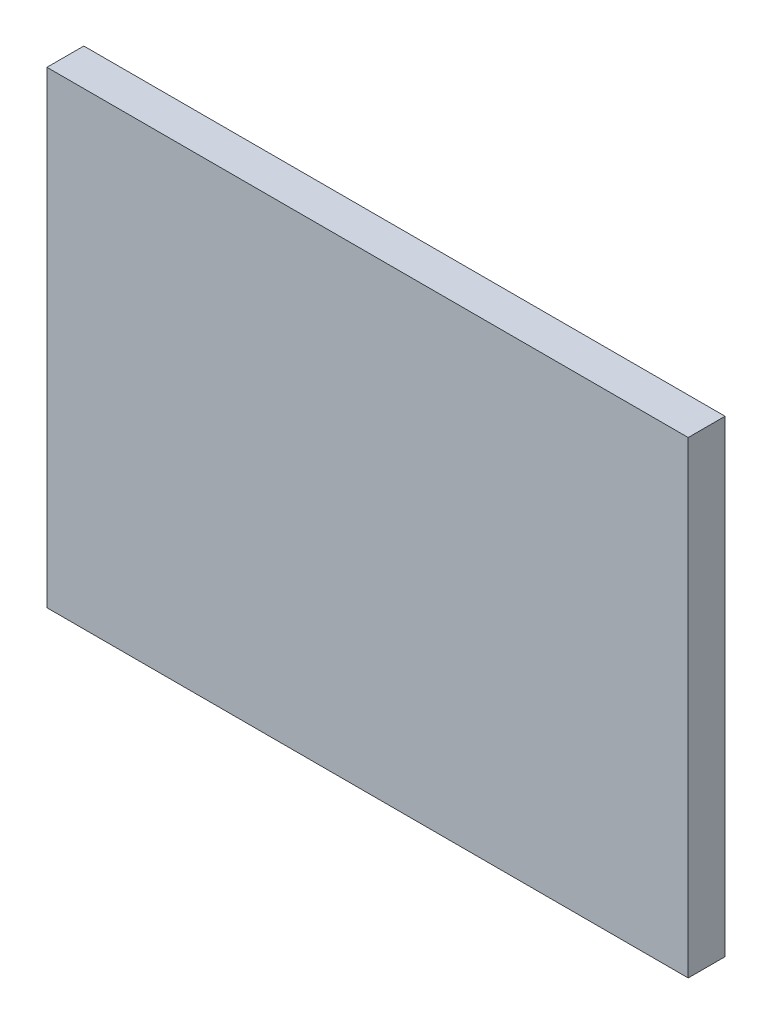
ISO-10303-21;
HEADER;
FILE_DESCRIPTION(('STEP AP214'),'2;1');
FILE_NAME('part.step','',(''),(''),'','','');
FILE_SCHEMA(('AUTOMOTIVE_DESIGN { 1 0 10303 214 1 1 1 1 }'));
ENDSEC;
DATA;
#1=APPLICATION_CONTEXT('core data for automotive mechanical design processes');
#2=APPLICATION_PROTOCOL_DEFINITION('international standard','automotive_design',2000,#1);
#3=PRODUCT_CONTEXT('',#1,'mechanical');
#4=PRODUCT('Part','Part','',(#3));
#5=PRODUCT_RELATED_PRODUCT_CATEGORY('part','',(#4));
#6=PRODUCT_DEFINITION_FORMATION('','',#4);
#7=PRODUCT_DEFINITION_CONTEXT('part definition',#1,'design');
#8=PRODUCT_DEFINITION('design','',#6,#7);
#9=PRODUCT_DEFINITION_SHAPE('','',#8);
#10=(LENGTH_UNIT() NAMED_UNIT(*) SI_UNIT(.MILLI.,.METRE.));
#11=(NAMED_UNIT(*) PLANE_ANGLE_UNIT() SI_UNIT($,.RADIAN.));
#12=(NAMED_UNIT(*) SI_UNIT($,.STERADIAN.) SOLID_ANGLE_UNIT());
#13=UNCERTAINTY_MEASURE_WITH_UNIT(LENGTH_MEASURE(1.E-05),#10,'distance_accuracy_value','');
#14=(GEOMETRIC_REPRESENTATION_CONTEXT(3) GLOBAL_UNCERTAINTY_ASSIGNED_CONTEXT((#13)) GLOBAL_UNIT_ASSIGNED_CONTEXT((#10,
#11,#12)) REPRESENTATION_CONTEXT('',''));
#15=CARTESIAN_POINT('',(0.,0.,0.));
#16=DIRECTION('',(0.,0.,1.));
#17=DIRECTION('',(1.,0.,0.));
#18=AXIS2_PLACEMENT_3D('',#15,#16,#17);
#19=CARTESIAN_POINT('',(-34.798,25.4,4.));
#20=DIRECTION('',(0.,-1.,0.));
#21=DIRECTION('',(1.,0.,0.));
#22=AXIS2_PLACEMENT_3D('',#19,#20,#21);
#23=PLANE('',#22);
#24=DIRECTION('',(-1.,0.,0.));
#25=VECTOR('',#24,1.);
#26=CARTESIAN_POINT('',(-34.798,25.4,0.));
#27=LINE('',#26,#25);
#28=CARTESIAN_POINT('',(34.798,25.4,0.));
#29=VERTEX_POINT('',#28);
#30=CARTESIAN_POINT('',(-34.798,25.4,0.));
#31=VERTEX_POINT('',#30);
#32=EDGE_CURVE('E107',#29,#31,#27,.T.);
#33=ORIENTED_EDGE('',*,*,#32,.T.);
#34=DIRECTION('',(0.,0.,-1.));
#35=VECTOR('',#34,1.);
#36=CARTESIAN_POINT('',(-34.798,25.4,4.));
#37=LINE('',#36,#35);
#38=CARTESIAN_POINT('',(-34.798,25.4,4.));
#39=VERTEX_POINT('',#38);
#40=EDGE_CURVE('E11',#39,#31,#37,.T.);
#41=ORIENTED_EDGE('',*,*,#40,.F.);
#42=DIRECTION('',(-1.,0.,0.));
#43=VECTOR('',#42,1.);
#44=CARTESIAN_POINT('',(-34.798,25.4,4.));
#45=LINE('',#44,#43);
#46=CARTESIAN_POINT('',(34.798,25.4,4.));
#47=VERTEX_POINT('',#46);
#48=EDGE_CURVE('E91',#47,#39,#45,.T.);
#49=ORIENTED_EDGE('',*,*,#48,.F.);
#50=DIRECTION('',(0.,0.,-1.));
#51=VECTOR('',#50,1.);
#52=CARTESIAN_POINT('',(34.798,25.4,4.));
#53=LINE('',#52,#51);
#54=EDGE_CURVE('E103',#47,#29,#53,.T.);
#55=ORIENTED_EDGE('',*,*,#54,.T.);
#56=EDGE_LOOP('',(#33,#41,#49,#55));
#57=FACE_BOUND('',#56,.T.);
#58=ADVANCED_FACE('F39',(#57),#23,.F.);
#59=CARTESIAN_POINT('',(-34.798,-25.4,4.));
#60=DIRECTION('',(1.,0.,0.));
#61=DIRECTION('',(0.,1.,0.));
#62=AXIS2_PLACEMENT_3D('',#59,#60,#61);
#63=PLANE('',#62);
#64=DIRECTION('',(0.,-1.,0.));
#65=VECTOR('',#64,1.);
#66=CARTESIAN_POINT('',(-34.798,-25.4,0.));
#67=LINE('',#66,#65);
#68=CARTESIAN_POINT('',(-34.798,-25.4,0.));
#69=VERTEX_POINT('',#68);
#70=EDGE_CURVE('E96',#31,#69,#67,.T.);
#71=ORIENTED_EDGE('',*,*,#70,.T.);
#72=DIRECTION('',(0.,0.,-1.));
#73=VECTOR('',#72,1.);
#74=CARTESIAN_POINT('',(-34.798,-25.4,4.));
#75=LINE('',#74,#73);
#76=CARTESIAN_POINT('',(-34.798,-25.4,4.));
#77=VERTEX_POINT('',#76);
#78=EDGE_CURVE('E48',#77,#69,#75,.T.);
#79=ORIENTED_EDGE('',*,*,#78,.F.);
#80=DIRECTION('',(0.,-1.,0.));
#81=VECTOR('',#80,1.);
#82=CARTESIAN_POINT('',(-34.798,-25.4,4.));
#83=LINE('',#82,#81);
#84=EDGE_CURVE('E86',#39,#77,#83,.T.);
#85=ORIENTED_EDGE('',*,*,#84,.F.);
#86=ORIENTED_EDGE('',*,*,#40,.T.);
#87=EDGE_LOOP('',(#71,#79,#85,#86));
#88=FACE_BOUND('',#87,.T.);
#89=ADVANCED_FACE('F95',(#88),#63,.F.);
#90=CARTESIAN_POINT('',(-34.798,-25.4,4.));
#91=DIRECTION('',(0.,1.,0.));
#92=DIRECTION('',(-1.,0.,0.));
#93=AXIS2_PLACEMENT_3D('',#90,#91,#92);
#94=PLANE('',#93);
#95=DIRECTION('',(1.,0.,0.));
#96=VECTOR('',#95,1.);
#97=CARTESIAN_POINT('',(-34.798,-25.4,0.));
#98=LINE('',#97,#96);
#99=CARTESIAN_POINT('',(34.798,-25.4,0.));
#100=VERTEX_POINT('',#99);
#101=EDGE_CURVE('E73',#69,#100,#98,.T.);
#102=ORIENTED_EDGE('',*,*,#101,.T.);
#103=DIRECTION('',(0.,0.,-1.));
#104=VECTOR('',#103,1.);
#105=CARTESIAN_POINT('',(34.798,-25.4,4.));
#106=LINE('',#105,#104);
#107=CARTESIAN_POINT('',(34.798,-25.4,4.));
#108=VERTEX_POINT('',#107);
#109=EDGE_CURVE('E98',#108,#100,#106,.T.);
#110=ORIENTED_EDGE('',*,*,#109,.F.);
#111=DIRECTION('',(1.,0.,0.));
#112=VECTOR('',#111,1.);
#113=CARTESIAN_POINT('',(-34.798,-25.4,4.));
#114=LINE('',#113,#112);
#115=EDGE_CURVE('E89',#77,#108,#114,.T.);
#116=ORIENTED_EDGE('',*,*,#115,.F.);
#117=ORIENTED_EDGE('',*,*,#78,.T.);
#118=EDGE_LOOP('',(#102,#110,#116,#117));
#119=FACE_BOUND('',#118,.T.);
#120=ADVANCED_FACE('F99',(#119),#94,.F.);
#121=CARTESIAN_POINT('',(34.798,-25.4,4.));
#122=DIRECTION('',(-1.,0.,0.));
#123=DIRECTION('',(0.,0.,1.));
#124=AXIS2_PLACEMENT_3D('',#121,#122,#123);
#125=PLANE('',#124);
#126=DIRECTION('',(0.,1.,0.));
#127=VECTOR('',#126,1.);
#128=CARTESIAN_POINT('',(34.798,-25.4,0.));
#129=LINE('',#128,#127);
#130=EDGE_CURVE('E79',#100,#29,#129,.T.);
#131=ORIENTED_EDGE('',*,*,#130,.T.);
#132=ORIENTED_EDGE('',*,*,#54,.F.);
#133=DIRECTION('',(0.,1.,0.));
#134=VECTOR('',#133,1.);
#135=CARTESIAN_POINT('',(34.798,-25.4,4.));
#136=LINE('',#135,#134);
#137=EDGE_CURVE('E56',#108,#47,#136,.T.);
#138=ORIENTED_EDGE('',*,*,#137,.F.);
#139=ORIENTED_EDGE('',*,*,#109,.T.);
#140=EDGE_LOOP('',(#131,#132,#138,#139));
#141=FACE_BOUND('',#140,.T.);
#142=ADVANCED_FACE('F120',(#141),#125,.F.);
#143=CARTESIAN_POINT('',(0.,0.,4.));
#144=DIRECTION('',(0.,0.,1.));
#145=DIRECTION('',(1.,0.,0.));
#146=AXIS2_PLACEMENT_3D('',#143,#144,#145);
#147=PLANE('',#146);
#148=ORIENTED_EDGE('',*,*,#48,.T.);
#149=ORIENTED_EDGE('',*,*,#84,.T.);
#150=ORIENTED_EDGE('',*,*,#115,.T.);
#151=ORIENTED_EDGE('',*,*,#137,.T.);
#152=EDGE_LOOP('',(#148,#149,#150,#151));
#153=FACE_BOUND('',#152,.T.);
#154=ADVANCED_FACE('F87',(#153),#147,.T.);
#155=CARTESIAN_POINT('',(0.,0.,0.));
#156=DIRECTION('',(0.,0.,1.));
#157=DIRECTION('',(1.,0.,0.));
#158=AXIS2_PLACEMENT_3D('',#155,#156,#157);
#159=PLANE('',#158);
#160=ORIENTED_EDGE('',*,*,#32,.F.);
#161=ORIENTED_EDGE('',*,*,#130,.F.);
#162=ORIENTED_EDGE('',*,*,#101,.F.);
#163=ORIENTED_EDGE('',*,*,#70,.F.);
#164=EDGE_LOOP('',(#160,#161,#162,#163));
#165=FACE_BOUND('',#164,.T.);
#166=ADVANCED_FACE('F123',(#165),#159,.F.);
#167=CLOSED_SHELL('',(#58,#89,#120,#142,#154,#166));
#168=MANIFOLD_SOLID_BREP('B2',#167);
#169=ADVANCED_BREP_SHAPE_REPRESENTATION('',(#18,#168),#14);
#170=SHAPE_DEFINITION_REPRESENTATION(#9,#169);
ENDSEC;
END-ISO-10303-21;
